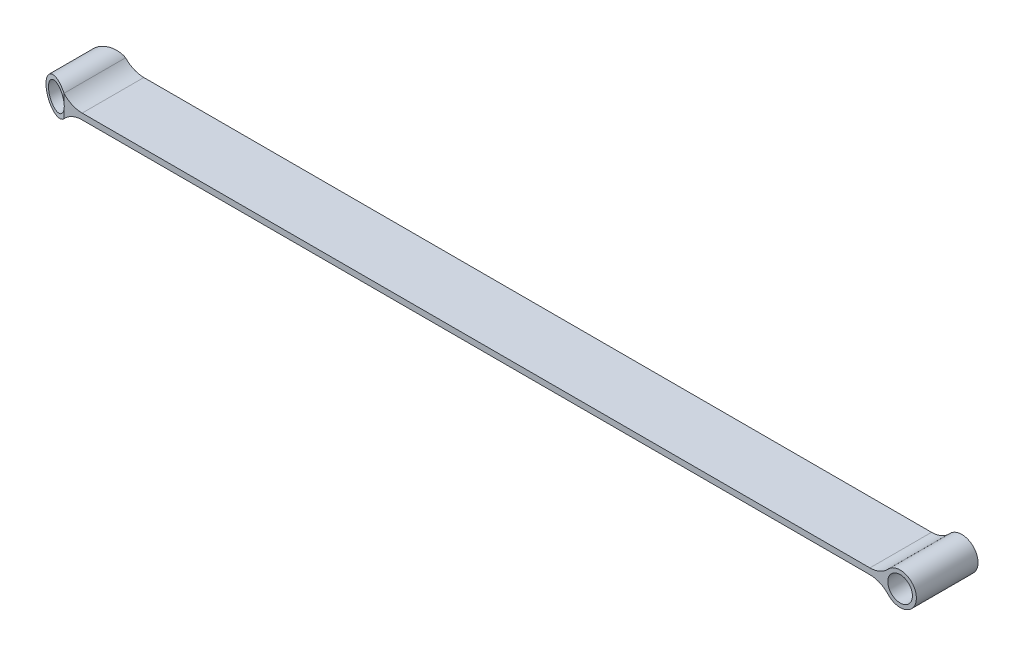
ISO-10303-21;
HEADER;
FILE_DESCRIPTION(('STEP AP214'),'2;1');
FILE_NAME('part.step','',(''),(''),'','','');
FILE_SCHEMA(('AUTOMOTIVE_DESIGN { 1 0 10303 214 1 1 1 1 }'));
ENDSEC;
DATA;
#1=APPLICATION_CONTEXT('core data for automotive mechanical design processes');
#2=APPLICATION_PROTOCOL_DEFINITION('international standard','automotive_design',2000,#1);
#3=PRODUCT_CONTEXT('',#1,'mechanical');
#4=PRODUCT('Part','Part','',(#3));
#5=PRODUCT_RELATED_PRODUCT_CATEGORY('part','',(#4));
#6=PRODUCT_DEFINITION_FORMATION('','',#4);
#7=PRODUCT_DEFINITION_CONTEXT('part definition',#1,'design');
#8=PRODUCT_DEFINITION('design','',#6,#7);
#9=PRODUCT_DEFINITION_SHAPE('','',#8);
#10=(LENGTH_UNIT() NAMED_UNIT(*) SI_UNIT(.MILLI.,.METRE.));
#11=(NAMED_UNIT(*) PLANE_ANGLE_UNIT() SI_UNIT($,.RADIAN.));
#12=(NAMED_UNIT(*) SI_UNIT($,.STERADIAN.) SOLID_ANGLE_UNIT());
#13=UNCERTAINTY_MEASURE_WITH_UNIT(LENGTH_MEASURE(1.E-05),#10,'distance_accuracy_value','');
#14=(GEOMETRIC_REPRESENTATION_CONTEXT(3) GLOBAL_UNCERTAINTY_ASSIGNED_CONTEXT((#13)) GLOBAL_UNIT_ASSIGNED_CONTEXT((#10,
#11,#12)) REPRESENTATION_CONTEXT('',''));
#15=CARTESIAN_POINT('',(0.,0.,0.));
#16=DIRECTION('',(0.,0.,1.));
#17=DIRECTION('',(1.,0.,0.));
#18=AXIS2_PLACEMENT_3D('',#15,#16,#17);
#19=CARTESIAN_POINT('',(-101.6,1.524,-7.9375));
#20=DIRECTION('',(0.,0.,1.));
#21=DIRECTION('',(1.,0.,0.));
#22=AXIS2_PLACEMENT_3D('',#19,#20,#21);
#23=PLANE('',#22);
#24=CARTESIAN_POINT('',(109.22,0.762,-7.9375));
#25=DIRECTION('',(0.,0.,-1.));
#26=DIRECTION('',(-1.,0.,0.));
#27=AXIS2_PLACEMENT_3D('',#24,#25,#26);
#28=CIRCLE('',#27,3.175);
#29=CARTESIAN_POINT('',(106.045,0.762,-7.9375));
#30=VERTEX_POINT('',#29);
#31=EDGE_CURVE('E194',#30,#30,#28,.T.);
#32=ORIENTED_EDGE('',*,*,#31,.F.);
#33=EDGE_LOOP('',(#32));
#34=FACE_BOUND('',#33,.T.);
#35=DIRECTION('',(0.,-1.,0.));
#36=VECTOR('',#35,1.);
#37=CARTESIAN_POINT('',(-106.126651501303,4.953,-7.9375));
#38=LINE('',#37,#36);
#39=CARTESIAN_POINT('',(-106.126651501303,3.58966265060242,-7.9375));
#40=VERTEX_POINT('',#39);
#41=CARTESIAN_POINT('',(-106.126651501303,1.47741600877522,-7.9375));
#42=VERTEX_POINT('',#41);
#43=EDGE_CURVE('E72',#40,#42,#38,.T.);
#44=ORIENTED_EDGE('',*,*,#43,.F.);
#45=CARTESIAN_POINT('',(-101.439759836612,7.874,-7.9375));
#46=DIRECTION('',(0.,0.,1.));
#47=DIRECTION('',(1.,0.,0.));
#48=AXIS2_PLACEMENT_3D('',#45,#46,#47);
#49=CIRCLE('',#48,6.35);
#50=CARTESIAN_POINT('',(-101.439759836612,1.524,-7.9375));
#51=VERTEX_POINT('',#50);
#52=EDGE_CURVE('E152',#51,#40,#49,.F.);
#53=ORIENTED_EDGE('',*,*,#52,.F.);
#54=DIRECTION('',(-1.,0.,0.));
#55=VECTOR('',#54,1.);
#56=CARTESIAN_POINT('',(-101.6,1.524,-7.9375));
#57=LINE('',#56,#55);
#58=CARTESIAN_POINT('',(101.439759836612,1.524,-7.9375));
#59=VERTEX_POINT('',#58);
#60=EDGE_CURVE('E56',#59,#51,#57,.T.);
#61=ORIENTED_EDGE('',*,*,#60,.F.);
#62=CARTESIAN_POINT('',(101.439759836612,7.874,-7.9375));
#63=DIRECTION('',(0.,0.,-1.));
#64=DIRECTION('',(-1.,0.,0.));
#65=AXIS2_PLACEMENT_3D('',#62,#63,#64);
#66=CIRCLE('',#65,6.35);
#67=CARTESIAN_POINT('',(106.126651501303,3.58966265060241,-7.9375));
#68=VERTEX_POINT('',#67);
#69=EDGE_CURVE('E226',#59,#68,#66,.F.);
#70=ORIENTED_EDGE('',*,*,#69,.T.);
#71=CARTESIAN_POINT('',(109.22,0.762,-7.9375));
#72=DIRECTION('',(0.,0.,-1.));
#73=DIRECTION('',(-1.,0.,0.));
#74=AXIS2_PLACEMENT_3D('',#71,#72,#73);
#75=CIRCLE('',#74,4.191);
#76=CARTESIAN_POINT('',(106.126651501303,-2.06566265060241,-7.9375));
#77=VERTEX_POINT('',#76);
#78=EDGE_CURVE('E198',#68,#77,#75,.T.);
#79=ORIENTED_EDGE('',*,*,#78,.T.);
#80=CARTESIAN_POINT('',(101.439759836612,-6.35,-7.9375));
#81=DIRECTION('',(0.,0.,-1.));
#82=DIRECTION('',(-1.,0.,0.));
#83=AXIS2_PLACEMENT_3D('',#80,#81,#82);
#84=CIRCLE('',#83,6.35);
#85=CARTESIAN_POINT('',(101.439759836612,0.,-7.9375));
#86=VERTEX_POINT('',#85);
#87=EDGE_CURVE('E211',#77,#86,#84,.F.);
#88=ORIENTED_EDGE('',*,*,#87,.T.);
#89=DIRECTION('',(-1.,0.,0.));
#90=VECTOR('',#89,1.);
#91=CARTESIAN_POINT('',(-101.6,0.,-7.9375));
#92=LINE('',#91,#90);
#93=CARTESIAN_POINT('',(-101.439759836612,0.,-7.9375));
#94=VERTEX_POINT('',#93);
#95=EDGE_CURVE('E153',#86,#94,#92,.T.);
#96=ORIENTED_EDGE('',*,*,#95,.T.);
#97=CARTESIAN_POINT('',(-101.439759836612,-6.35,-7.9375));
#98=DIRECTION('',(0.,0.,1.));
#99=DIRECTION('',(1.,0.,0.));
#100=AXIS2_PLACEMENT_3D('',#97,#98,#99);
#101=CIRCLE('',#100,6.35);
#102=CARTESIAN_POINT('',(-106.126651501303,-2.06566265060241,-7.9375));
#103=VERTEX_POINT('',#102);
#104=EDGE_CURVE('E164',#103,#94,#101,.F.);
#105=ORIENTED_EDGE('',*,*,#104,.F.);
#106=CARTESIAN_POINT('',(-106.126651501303,0.0465839912247837,-7.9375));
#107=VERTEX_POINT('',#106);
#108=EDGE_CURVE('E132',#107,#103,#38,.T.);
#109=ORIENTED_EDGE('',*,*,#108,.F.);
#110=CARTESIAN_POINT('',(-109.22,0.762,-7.9375));
#111=DIRECTION('',(0.,0.,1.));
#112=DIRECTION('',(1.,0.,0.));
#113=AXIS2_PLACEMENT_3D('',#110,#111,#112);
#114=CIRCLE('',#113,3.175);
#115=EDGE_CURVE('E160',#107,#42,#114,.T.);
#116=ORIENTED_EDGE('',*,*,#115,.T.);
#117=EDGE_LOOP('',(#44,#53,#61,#70,#79,#88,#96,#105,#109,#116));
#118=FACE_BOUND('',#117,.T.);
#119=ADVANCED_FACE('F48',(#34,#118),#23,.F.);
#120=CARTESIAN_POINT('',(-109.22,0.762,-7.9375));
#121=DIRECTION('',(0.,0.,1.));
#122=DIRECTION('',(1.,0.,0.));
#123=AXIS2_PLACEMENT_3D('',#120,#121,#122);
#124=CYLINDRICAL_SURFACE('',#123,4.191);
#125=DIRECTION('',(0.,0.,1.));
#126=VECTOR('',#125,1.);
#127=CARTESIAN_POINT('',(-106.126651501303,3.58966265060241,-7.9375));
#128=LINE('',#127,#126);
#129=CARTESIAN_POINT('',(-106.126651501303,3.58966265060242,7.9375));
#130=VERTEX_POINT('',#129);
#131=EDGE_CURVE('E139',#40,#130,#128,.T.);
#132=ORIENTED_EDGE('',*,*,#131,.F.);
#133=CARTESIAN_POINT('',(-109.22,0.762,-6.81161322226244));
#134=DIRECTION('',(-0.342020143325663,0.,-0.93969262078591));
#135=DIRECTION('',(-0.93969262078591,0.,0.342020143325663));
#136=AXIS2_PLACEMENT_3D('',#133,#134,#135);
#137=ELLIPSE('',#136,4.45996904444653,4.191);
#138=EDGE_CURVE('E221',#40,#103,#137,.F.);
#139=ORIENTED_EDGE('',*,*,#138,.T.);
#140=DIRECTION('',(0.,0.,1.));
#141=VECTOR('',#140,1.);
#142=CARTESIAN_POINT('',(-106.126651501303,-2.06566265060241,-7.9375));
#143=LINE('',#142,#141);
#144=CARTESIAN_POINT('',(-106.126651501303,-2.06566265060241,7.9375));
#145=VERTEX_POINT('',#144);
#146=EDGE_CURVE('E142',#103,#145,#143,.T.);
#147=ORIENTED_EDGE('',*,*,#146,.T.);
#148=CARTESIAN_POINT('',(-109.22,0.762,6.81161322226244));
#149=DIRECTION('',(0.342020143325663,0.,-0.93969262078591));
#150=DIRECTION('',(0.93969262078591,0.,0.342020143325663));
#151=AXIS2_PLACEMENT_3D('',#148,#149,#150);
#152=ELLIPSE('',#151,4.45996904444653,4.191);
#153=EDGE_CURVE('E126',#130,#145,#152,.F.);
#154=ORIENTED_EDGE('',*,*,#153,.F.);
#155=EDGE_LOOP('',(#132,#139,#147,#154));
#156=FACE_BOUND('',#155,.T.);
#157=ADVANCED_FACE('F138',(#156),#124,.T.);
#158=CARTESIAN_POINT('',(-109.22,0.762,-7.9375));
#159=DIRECTION('',(0.,0.,1.));
#160=DIRECTION('',(1.,0.,0.));
#161=AXIS2_PLACEMENT_3D('',#158,#159,#160);
#162=CYLINDRICAL_SURFACE('',#161,3.175);
#163=CARTESIAN_POINT('',(-109.22,0.762,7.9375));
#164=DIRECTION('',(0.,0.,1.));
#165=DIRECTION('',(1.,0.,0.));
#166=AXIS2_PLACEMENT_3D('',#163,#164,#165);
#167=CIRCLE('',#166,3.175);
#168=CARTESIAN_POINT('',(-106.126651501303,0.0465839912247604,7.9375));
#169=VERTEX_POINT('',#168);
#170=CARTESIAN_POINT('',(-106.126651501303,1.47741600877522,7.9375));
#171=VERTEX_POINT('',#170);
#172=EDGE_CURVE('E166',#169,#171,#167,.T.);
#173=ORIENTED_EDGE('',*,*,#172,.T.);
#174=CARTESIAN_POINT('',(-109.22,0.762,6.81161322226244));
#175=DIRECTION('',(0.342020143325663,0.,-0.93969262078591));
#176=DIRECTION('',(0.93969262078591,0.,0.342020143325663));
#177=AXIS2_PLACEMENT_3D('',#174,#175,#176);
#178=ELLIPSE('',#177,3.37876442761101,3.175);
#179=EDGE_CURVE('E127',#171,#169,#178,.F.);
#180=ORIENTED_EDGE('',*,*,#179,.T.);
#181=EDGE_LOOP('',(#173,#180));
#182=FACE_BOUND('',#181,.T.);
#183=CARTESIAN_POINT('',(-109.22,0.762,-6.81161322226244));
#184=DIRECTION('',(-0.342020143325663,0.,-0.93969262078591));
#185=DIRECTION('',(-0.93969262078591,0.,0.342020143325663));
#186=AXIS2_PLACEMENT_3D('',#183,#184,#185);
#187=ELLIPSE('',#186,3.37876442761101,3.175);
#188=EDGE_CURVE('E144',#42,#107,#187,.F.);
#189=ORIENTED_EDGE('',*,*,#188,.F.);
#190=ORIENTED_EDGE('',*,*,#115,.F.);
#191=EDGE_LOOP('',(#189,#190));
#192=FACE_BOUND('',#191,.T.);
#193=ADVANCED_FACE('F215',(#182,#192),#162,.F.);
#194=CARTESIAN_POINT('',(0.,1.524,0.));
#195=DIRECTION('',(0.,-1.,0.));
#196=DIRECTION('',(0.,0.,-1.));
#197=AXIS2_PLACEMENT_3D('',#194,#195,#196);
#198=PLANE('',#197);
#199=DIRECTION('',(0.,0.,1.));
#200=VECTOR('',#199,1.);
#201=CARTESIAN_POINT('',(101.439759836612,1.524,-7.9375));
#202=LINE('',#201,#200);
#203=CARTESIAN_POINT('',(101.439759836612,1.524,7.9375));
#204=VERTEX_POINT('',#203);
#205=EDGE_CURVE('E206',#59,#204,#202,.T.);
#206=ORIENTED_EDGE('',*,*,#205,.F.);
#207=ORIENTED_EDGE('',*,*,#60,.T.);
#208=DIRECTION('',(0.,0.,1.));
#209=VECTOR('',#208,1.);
#210=CARTESIAN_POINT('',(-101.439759836612,1.524,-7.9375));
#211=LINE('',#210,#209);
#212=CARTESIAN_POINT('',(-101.439759836612,1.524,7.9375));
#213=VERTEX_POINT('',#212);
#214=EDGE_CURVE('E154',#51,#213,#211,.T.);
#215=ORIENTED_EDGE('',*,*,#214,.T.);
#216=DIRECTION('',(1.,0.,0.));
#217=VECTOR('',#216,1.);
#218=CARTESIAN_POINT('',(-101.6,1.524,7.9375));
#219=LINE('',#218,#217);
#220=EDGE_CURVE('E13',#213,#204,#219,.T.);
#221=ORIENTED_EDGE('',*,*,#220,.T.);
#222=EDGE_LOOP('',(#206,#207,#215,#221));
#223=FACE_BOUND('',#222,.T.);
#224=ADVANCED_FACE('F239',(#223),#198,.F.);
#225=CARTESIAN_POINT('',(0.,0.,0.));
#226=DIRECTION('',(0.,-1.,0.));
#227=DIRECTION('',(0.,0.,-1.));
#228=AXIS2_PLACEMENT_3D('',#225,#226,#227);
#229=PLANE('',#228);
#230=ORIENTED_EDGE('',*,*,#95,.F.);
#231=DIRECTION('',(0.,0.,1.));
#232=VECTOR('',#231,1.);
#233=CARTESIAN_POINT('',(101.439759836612,0.,-7.9375));
#234=LINE('',#233,#232);
#235=CARTESIAN_POINT('',(101.439759836612,0.,7.9375));
#236=VERTEX_POINT('',#235);
#237=EDGE_CURVE('E190',#86,#236,#234,.T.);
#238=ORIENTED_EDGE('',*,*,#237,.T.);
#239=DIRECTION('',(1.,0.,0.));
#240=VECTOR('',#239,1.);
#241=CARTESIAN_POINT('',(-101.6,0.,7.9375));
#242=LINE('',#241,#240);
#243=CARTESIAN_POINT('',(-101.439759836612,0.,7.9375));
#244=VERTEX_POINT('',#243);
#245=EDGE_CURVE('E51',#244,#236,#242,.T.);
#246=ORIENTED_EDGE('',*,*,#245,.F.);
#247=DIRECTION('',(0.,0.,1.));
#248=VECTOR('',#247,1.);
#249=CARTESIAN_POINT('',(-101.439759836612,0.,-7.9375));
#250=LINE('',#249,#248);
#251=EDGE_CURVE('E171',#94,#244,#250,.T.);
#252=ORIENTED_EDGE('',*,*,#251,.F.);
#253=EDGE_LOOP('',(#230,#238,#246,#252));
#254=FACE_BOUND('',#253,.T.);
#255=ADVANCED_FACE('F246',(#254),#229,.T.);
#256=CARTESIAN_POINT('',(-101.6,1.524,7.9375));
#257=DIRECTION('',(0.,0.,-1.));
#258=DIRECTION('',(-1.,0.,0.));
#259=AXIS2_PLACEMENT_3D('',#256,#257,#258);
#260=PLANE('',#259);
#261=CARTESIAN_POINT('',(-101.439759836612,7.874,7.9375));
#262=DIRECTION('',(0.,0.,1.));
#263=DIRECTION('',(1.,0.,0.));
#264=AXIS2_PLACEMENT_3D('',#261,#262,#263);
#265=CIRCLE('',#264,6.35);
#266=EDGE_CURVE('E149',#213,#130,#265,.F.);
#267=ORIENTED_EDGE('',*,*,#266,.T.);
#268=DIRECTION('',(0.,-1.,0.));
#269=VECTOR('',#268,1.);
#270=CARTESIAN_POINT('',(-106.126651501303,4.953,7.9375));
#271=LINE('',#270,#269);
#272=EDGE_CURVE('E123',#130,#171,#271,.T.);
#273=ORIENTED_EDGE('',*,*,#272,.T.);
#274=ORIENTED_EDGE('',*,*,#172,.F.);
#275=EDGE_CURVE('E64',#169,#145,#271,.T.);
#276=ORIENTED_EDGE('',*,*,#275,.T.);
#277=CARTESIAN_POINT('',(-101.439759836612,-6.35,7.9375));
#278=DIRECTION('',(0.,0.,1.));
#279=DIRECTION('',(1.,0.,0.));
#280=AXIS2_PLACEMENT_3D('',#277,#278,#279);
#281=CIRCLE('',#280,6.35);
#282=EDGE_CURVE('E161',#145,#244,#281,.F.);
#283=ORIENTED_EDGE('',*,*,#282,.T.);
#284=ORIENTED_EDGE('',*,*,#245,.T.);
#285=CARTESIAN_POINT('',(101.439759836612,-6.35,7.9375));
#286=DIRECTION('',(0.,0.,-1.));
#287=DIRECTION('',(-1.,0.,0.));
#288=AXIS2_PLACEMENT_3D('',#285,#286,#287);
#289=CIRCLE('',#288,6.35);
#290=CARTESIAN_POINT('',(106.126651501303,-2.06566265060241,7.9375));
#291=VERTEX_POINT('',#290);
#292=EDGE_CURVE('E183',#291,#236,#289,.F.);
#293=ORIENTED_EDGE('',*,*,#292,.F.);
#294=CARTESIAN_POINT('',(109.22,0.762,7.9375));
#295=DIRECTION('',(0.,0.,-1.));
#296=DIRECTION('',(-1.,0.,0.));
#297=AXIS2_PLACEMENT_3D('',#294,#295,#296);
#298=CIRCLE('',#297,4.191);
#299=CARTESIAN_POINT('',(106.126651501303,3.58966265060241,7.9375));
#300=VERTEX_POINT('',#299);
#301=EDGE_CURVE('E200',#300,#291,#298,.T.);
#302=ORIENTED_EDGE('',*,*,#301,.F.);
#303=CARTESIAN_POINT('',(101.439759836612,7.874,7.9375));
#304=DIRECTION('',(0.,0.,-1.));
#305=DIRECTION('',(-1.,0.,0.));
#306=AXIS2_PLACEMENT_3D('',#303,#304,#305);
#307=CIRCLE('',#306,6.35);
#308=EDGE_CURVE('E195',#204,#300,#307,.F.);
#309=ORIENTED_EDGE('',*,*,#308,.F.);
#310=ORIENTED_EDGE('',*,*,#220,.F.);
#311=EDGE_LOOP('',(#267,#273,#274,#276,#283,#284,#293,#302,#309,#310));
#312=FACE_BOUND('',#311,.T.);
#313=CARTESIAN_POINT('',(109.22,0.762,7.9375));
#314=DIRECTION('',(0.,0.,-1.));
#315=DIRECTION('',(-1.,0.,0.));
#316=AXIS2_PLACEMENT_3D('',#313,#314,#315);
#317=CIRCLE('',#316,3.175);
#318=CARTESIAN_POINT('',(106.045,0.762,7.9375));
#319=VERTEX_POINT('',#318);
#320=EDGE_CURVE('E222',#319,#319,#317,.T.);
#321=ORIENTED_EDGE('',*,*,#320,.T.);
#322=EDGE_LOOP('',(#321));
#323=FACE_BOUND('',#322,.T.);
#324=ADVANCED_FACE('F157',(#312,#323),#260,.F.);
#325=CARTESIAN_POINT('',(-101.439759836612,7.874,-7.9375));
#326=DIRECTION('',(0.,0.,1.));
#327=DIRECTION('',(1.,0.,0.));
#328=AXIS2_PLACEMENT_3D('',#325,#326,#327);
#329=CYLINDRICAL_SURFACE('',#328,6.35);
#330=ORIENTED_EDGE('',*,*,#266,.F.);
#331=ORIENTED_EDGE('',*,*,#214,.F.);
#332=ORIENTED_EDGE('',*,*,#52,.T.);
#333=ORIENTED_EDGE('',*,*,#131,.T.);
#334=EDGE_LOOP('',(#330,#331,#332,#333));
#335=FACE_BOUND('',#334,.T.);
#336=ADVANCED_FACE('F147',(#335),#329,.F.);
#337=CARTESIAN_POINT('',(-101.439759836612,-6.35,-7.9375));
#338=DIRECTION('',(0.,0.,1.));
#339=DIRECTION('',(1.,0.,0.));
#340=AXIS2_PLACEMENT_3D('',#337,#338,#339);
#341=CYLINDRICAL_SURFACE('',#340,6.35);
#342=ORIENTED_EDGE('',*,*,#282,.F.);
#343=ORIENTED_EDGE('',*,*,#146,.F.);
#344=ORIENTED_EDGE('',*,*,#104,.T.);
#345=ORIENTED_EDGE('',*,*,#251,.T.);
#346=EDGE_LOOP('',(#342,#343,#344,#345));
#347=FACE_BOUND('',#346,.T.);
#348=ADVANCED_FACE('F245',(#347),#341,.F.);
#349=CARTESIAN_POINT('',(109.22,0.762,-7.9375));
#350=DIRECTION('',(0.,0.,1.));
#351=DIRECTION('',(1.,0.,0.));
#352=AXIS2_PLACEMENT_3D('',#349,#350,#351);
#353=CYLINDRICAL_SURFACE('',#352,4.191);
#354=ORIENTED_EDGE('',*,*,#301,.T.);
#355=DIRECTION('',(0.,0.,1.));
#356=VECTOR('',#355,1.);
#357=CARTESIAN_POINT('',(106.126651501303,-2.06566265060241,-7.9375));
#358=LINE('',#357,#356);
#359=EDGE_CURVE('E192',#77,#291,#358,.T.);
#360=ORIENTED_EDGE('',*,*,#359,.F.);
#361=ORIENTED_EDGE('',*,*,#78,.F.);
#362=DIRECTION('',(0.,0.,1.));
#363=VECTOR('',#362,1.);
#364=CARTESIAN_POINT('',(106.126651501303,3.58966265060241,-7.9375));
#365=LINE('',#364,#363);
#366=EDGE_CURVE('E209',#68,#300,#365,.T.);
#367=ORIENTED_EDGE('',*,*,#366,.T.);
#368=EDGE_LOOP('',(#354,#360,#361,#367));
#369=FACE_BOUND('',#368,.T.);
#370=ADVANCED_FACE('F231',(#369),#353,.T.);
#371=CARTESIAN_POINT('',(101.439759836612,-6.35,-7.9375));
#372=DIRECTION('',(0.,0.,1.));
#373=DIRECTION('',(1.,0.,0.));
#374=AXIS2_PLACEMENT_3D('',#371,#372,#373);
#375=CYLINDRICAL_SURFACE('',#374,6.35);
#376=ORIENTED_EDGE('',*,*,#292,.T.);
#377=ORIENTED_EDGE('',*,*,#237,.F.);
#378=ORIENTED_EDGE('',*,*,#87,.F.);
#379=ORIENTED_EDGE('',*,*,#359,.T.);
#380=EDGE_LOOP('',(#376,#377,#378,#379));
#381=FACE_BOUND('',#380,.T.);
#382=ADVANCED_FACE('F189',(#381),#375,.F.);
#383=CARTESIAN_POINT('',(109.22,0.762,-7.9375));
#384=DIRECTION('',(0.,0.,1.));
#385=DIRECTION('',(1.,0.,0.));
#386=AXIS2_PLACEMENT_3D('',#383,#384,#385);
#387=CYLINDRICAL_SURFACE('',#386,3.175);
#388=ORIENTED_EDGE('',*,*,#31,.T.);
#389=EDGE_LOOP('',(#388));
#390=FACE_BOUND('',#389,.T.);
#391=ORIENTED_EDGE('',*,*,#320,.F.);
#392=EDGE_LOOP('',(#391));
#393=FACE_BOUND('',#392,.T.);
#394=ADVANCED_FACE('F262',(#390,#393),#387,.F.);
#395=CARTESIAN_POINT('',(101.439759836612,7.874,-7.9375));
#396=DIRECTION('',(0.,0.,1.));
#397=DIRECTION('',(1.,0.,0.));
#398=AXIS2_PLACEMENT_3D('',#395,#396,#397);
#399=CYLINDRICAL_SURFACE('',#398,6.35);
#400=ORIENTED_EDGE('',*,*,#308,.T.);
#401=ORIENTED_EDGE('',*,*,#366,.F.);
#402=ORIENTED_EDGE('',*,*,#69,.F.);
#403=ORIENTED_EDGE('',*,*,#205,.T.);
#404=EDGE_LOOP('',(#400,#401,#402,#403));
#405=FACE_BOUND('',#404,.T.);
#406=ADVANCED_FACE('F235',(#405),#399,.F.);
#407=CARTESIAN_POINT('',(-14.9655232518958,4.953,41.1174372049076));
#408=DIRECTION('',(0.342020143325663,0.,-0.93969262078591));
#409=DIRECTION('',(-0.93969262078591,0.,-0.342020143325663));
#410=AXIS2_PLACEMENT_3D('',#407,#408,#409);
#411=PLANE('',#410);
#412=ORIENTED_EDGE('',*,*,#153,.T.);
#413=ORIENTED_EDGE('',*,*,#275,.F.);
#414=ORIENTED_EDGE('',*,*,#179,.F.);
#415=ORIENTED_EDGE('',*,*,#272,.F.);
#416=EDGE_LOOP('',(#412,#413,#414,#415));
#417=FACE_BOUND('',#416,.T.);
#418=ADVANCED_FACE('F125',(#417),#411,.F.);
#419=CARTESIAN_POINT('',(-14.9655232518958,4.953,-41.1174372049076));
#420=DIRECTION('',(-0.342020143325663,0.,-0.93969262078591));
#421=DIRECTION('',(-0.93969262078591,0.,0.342020143325663));
#422=AXIS2_PLACEMENT_3D('',#419,#420,#421);
#423=PLANE('',#422);
#424=ORIENTED_EDGE('',*,*,#138,.F.);
#425=ORIENTED_EDGE('',*,*,#43,.T.);
#426=ORIENTED_EDGE('',*,*,#188,.T.);
#427=ORIENTED_EDGE('',*,*,#108,.T.);
#428=EDGE_LOOP('',(#424,#425,#426,#427));
#429=FACE_BOUND('',#428,.T.);
#430=ADVANCED_FACE('F243',(#429),#423,.T.);
#431=CLOSED_SHELL('',(#119,#157,#193,#224,#255,#324,#336,#348,#370,#382,#394,#406,#418,#430));
#432=MANIFOLD_SOLID_BREP('B2',#431);
#433=ADVANCED_BREP_SHAPE_REPRESENTATION('',(#18,#432),#14);
#434=SHAPE_DEFINITION_REPRESENTATION(#9,#433);
ENDSEC;
END-ISO-10303-21;
